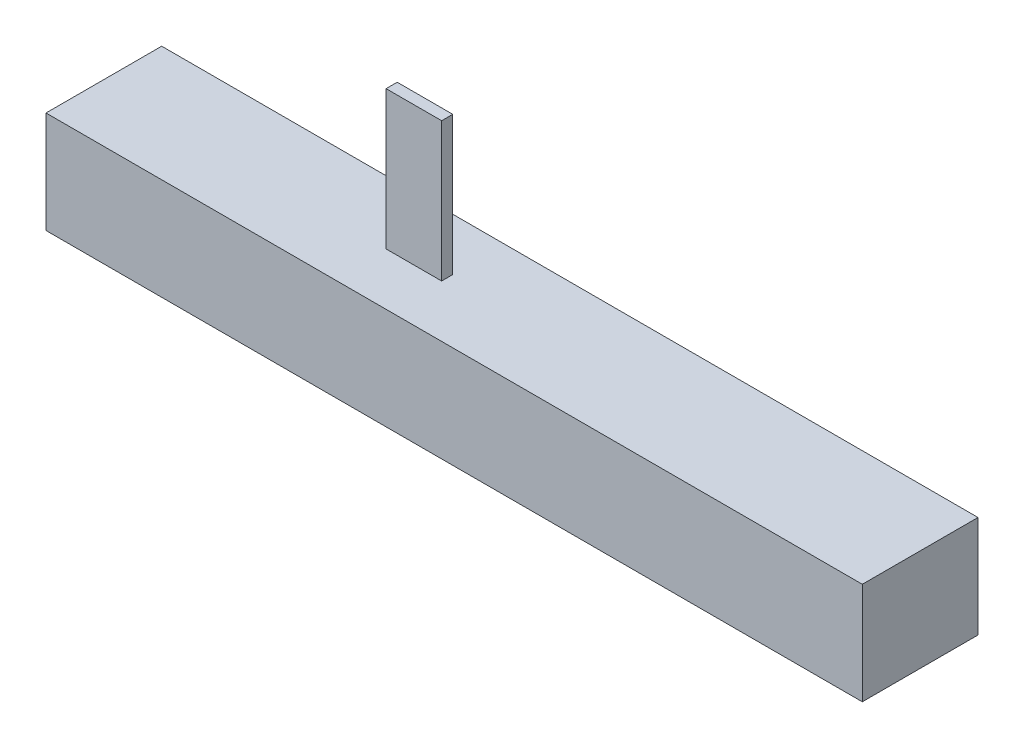
ISO-10303-21;
HEADER;
FILE_DESCRIPTION(('STEP AP214'),'2;1');
FILE_NAME('part.step','',(''),(''),'','','');
FILE_SCHEMA(('AUTOMOTIVE_DESIGN { 1 0 10303 214 1 1 1 1 }'));
ENDSEC;
DATA;
#1=APPLICATION_CONTEXT('core data for automotive mechanical design processes');
#2=APPLICATION_PROTOCOL_DEFINITION('international standard','automotive_design',2000,#1);
#3=PRODUCT_CONTEXT('',#1,'mechanical');
#4=PRODUCT('Part','Part','',(#3));
#5=PRODUCT_RELATED_PRODUCT_CATEGORY('part','',(#4));
#6=PRODUCT_DEFINITION_FORMATION('','',#4);
#7=PRODUCT_DEFINITION_CONTEXT('part definition',#1,'design');
#8=PRODUCT_DEFINITION('design','',#6,#7);
#9=PRODUCT_DEFINITION_SHAPE('','',#8);
#10=(LENGTH_UNIT() NAMED_UNIT(*) SI_UNIT(.MILLI.,.METRE.));
#11=(NAMED_UNIT(*) PLANE_ANGLE_UNIT() SI_UNIT($,.RADIAN.));
#12=(NAMED_UNIT(*) SI_UNIT($,.STERADIAN.) SOLID_ANGLE_UNIT());
#13=UNCERTAINTY_MEASURE_WITH_UNIT(LENGTH_MEASURE(1.E-05),#10,'distance_accuracy_value','');
#14=(GEOMETRIC_REPRESENTATION_CONTEXT(3) GLOBAL_UNCERTAINTY_ASSIGNED_CONTEXT((#13)) GLOBAL_UNIT_ASSIGNED_CONTEXT((#10,
#11,#12)) REPRESENTATION_CONTEXT('',''));
#15=CARTESIAN_POINT('',(0.,0.,0.));
#16=DIRECTION('',(0.,0.,1.));
#17=DIRECTION('',(1.,0.,0.));
#18=AXIS2_PLACEMENT_3D('',#15,#16,#17);
#19=CARTESIAN_POINT('',(-44.1,5.5,12.5));
#20=DIRECTION('',(0.,-1.,0.));
#21=DIRECTION('',(0.,0.,-1.));
#22=AXIS2_PLACEMENT_3D('',#19,#20,#21);
#23=PLANE('',#22);
#24=DIRECTION('',(-1.,0.,0.));
#25=VECTOR('',#24,1.);
#26=CARTESIAN_POINT('',(-44.1,5.5,0.));
#27=LINE('',#26,#25);
#28=CARTESIAN_POINT('',(44.1,5.5,0.));
#29=VERTEX_POINT('',#28);
#30=CARTESIAN_POINT('',(-44.1,5.5,0.));
#31=VERTEX_POINT('',#30);
#32=EDGE_CURVE('E121',#29,#31,#27,.T.);
#33=ORIENTED_EDGE('',*,*,#32,.T.);
#34=DIRECTION('',(0.,0.,-1.));
#35=VECTOR('',#34,1.);
#36=CARTESIAN_POINT('',(-44.1,5.5,12.5));
#37=LINE('',#36,#35);
#38=CARTESIAN_POINT('',(-44.1,5.5,12.5));
#39=VERTEX_POINT('',#38);
#40=EDGE_CURVE('E40',#39,#31,#37,.T.);
#41=ORIENTED_EDGE('',*,*,#40,.F.);
#42=DIRECTION('',(-1.,0.,0.));
#43=VECTOR('',#42,1.);
#44=CARTESIAN_POINT('',(-44.1,5.5,12.5));
#45=LINE('',#44,#43);
#46=CARTESIAN_POINT('',(44.1,5.5,12.5));
#47=VERTEX_POINT('',#46);
#48=EDGE_CURVE('E130',#47,#39,#45,.T.);
#49=ORIENTED_EDGE('',*,*,#48,.F.);
#50=DIRECTION('',(0.,0.,-1.));
#51=VECTOR('',#50,1.);
#52=CARTESIAN_POINT('',(44.1,5.5,12.5));
#53=LINE('',#52,#51);
#54=EDGE_CURVE('E11',#47,#29,#53,.T.);
#55=ORIENTED_EDGE('',*,*,#54,.T.);
#56=EDGE_LOOP('',(#33,#41,#49,#55));
#57=FACE_BOUND('',#56,.T.);
#58=DIRECTION('',(0.,0.,-1.));
#59=VECTOR('',#58,1.);
#60=CARTESIAN_POINT('',(-7.00262736585001,5.5,5.65));
#61=LINE('',#60,#59);
#62=CARTESIAN_POINT('',(-7.00262736585001,5.5,6.85));
#63=VERTEX_POINT('',#62);
#64=CARTESIAN_POINT('',(-7.00262736585001,5.5,5.65));
#65=VERTEX_POINT('',#64);
#66=EDGE_CURVE('E117',#63,#65,#61,.T.);
#67=ORIENTED_EDGE('',*,*,#66,.F.);
#68=DIRECTION('',(1.,0.,0.));
#69=VECTOR('',#68,1.);
#70=CARTESIAN_POINT('',(-13.00262736585,5.5,6.85));
#71=LINE('',#70,#69);
#72=CARTESIAN_POINT('',(-13.00262736585,5.5,6.85));
#73=VERTEX_POINT('',#72);
#74=EDGE_CURVE('E114',#73,#63,#71,.T.);
#75=ORIENTED_EDGE('',*,*,#74,.F.);
#76=DIRECTION('',(0.,0.,1.));
#77=VECTOR('',#76,1.);
#78=CARTESIAN_POINT('',(-13.00262736585,5.5,5.65));
#79=LINE('',#78,#77);
#80=CARTESIAN_POINT('',(-13.00262736585,5.5,5.65));
#81=VERTEX_POINT('',#80);
#82=EDGE_CURVE('E52',#81,#73,#79,.T.);
#83=ORIENTED_EDGE('',*,*,#82,.F.);
#84=DIRECTION('',(-1.,0.,0.));
#85=VECTOR('',#84,1.);
#86=CARTESIAN_POINT('',(-13.00262736585,5.5,5.65));
#87=LINE('',#86,#85);
#88=EDGE_CURVE('E47',#65,#81,#87,.T.);
#89=ORIENTED_EDGE('',*,*,#88,.F.);
#90=EDGE_LOOP('',(#67,#75,#83,#89));
#91=FACE_BOUND('',#90,.T.);
#92=ADVANCED_FACE('F32',(#57,#91),#23,.F.);
#93=CARTESIAN_POINT('',(44.1,-5.5,12.5));
#94=DIRECTION('',(-1.,0.,0.));
#95=DIRECTION('',(0.,0.,1.));
#96=AXIS2_PLACEMENT_3D('',#93,#94,#95);
#97=PLANE('',#96);
#98=DIRECTION('',(0.,1.,0.));
#99=VECTOR('',#98,1.);
#100=CARTESIAN_POINT('',(44.1,-5.5,0.));
#101=LINE('',#100,#99);
#102=CARTESIAN_POINT('',(44.1,-5.5,0.));
#103=VERTEX_POINT('',#102);
#104=EDGE_CURVE('E118',#103,#29,#101,.T.);
#105=ORIENTED_EDGE('',*,*,#104,.T.);
#106=ORIENTED_EDGE('',*,*,#54,.F.);
#107=DIRECTION('',(0.,1.,0.));
#108=VECTOR('',#107,1.);
#109=CARTESIAN_POINT('',(44.1,-5.5,12.5));
#110=LINE('',#109,#108);
#111=CARTESIAN_POINT('',(44.1,-5.5,12.5));
#112=VERTEX_POINT('',#111);
#113=EDGE_CURVE('E127',#112,#47,#110,.T.);
#114=ORIENTED_EDGE('',*,*,#113,.F.);
#115=DIRECTION('',(0.,0.,-1.));
#116=VECTOR('',#115,1.);
#117=CARTESIAN_POINT('',(44.1,-5.5,12.5));
#118=LINE('',#117,#116);
#119=EDGE_CURVE('E136',#112,#103,#118,.T.);
#120=ORIENTED_EDGE('',*,*,#119,.T.);
#121=EDGE_LOOP('',(#105,#106,#114,#120));
#122=FACE_BOUND('',#121,.T.);
#123=ADVANCED_FACE('F34',(#122),#97,.F.);
#124=CARTESIAN_POINT('',(-44.1,-5.5,12.5));
#125=DIRECTION('',(1.,0.,0.));
#126=DIRECTION('',(0.,0.,-1.));
#127=AXIS2_PLACEMENT_3D('',#124,#125,#126);
#128=PLANE('',#127);
#129=DIRECTION('',(0.,-1.,0.));
#130=VECTOR('',#129,1.);
#131=CARTESIAN_POINT('',(-44.1,-5.5,0.));
#132=LINE('',#131,#130);
#133=CARTESIAN_POINT('',(-44.1,-5.5,0.));
#134=VERTEX_POINT('',#133);
#135=EDGE_CURVE('E139',#31,#134,#132,.T.);
#136=ORIENTED_EDGE('',*,*,#135,.T.);
#137=DIRECTION('',(0.,0.,-1.));
#138=VECTOR('',#137,1.);
#139=CARTESIAN_POINT('',(-44.1,-5.5,12.5));
#140=LINE('',#139,#138);
#141=CARTESIAN_POINT('',(-44.1,-5.5,12.5));
#142=VERTEX_POINT('',#141);
#143=EDGE_CURVE('E144',#142,#134,#140,.T.);
#144=ORIENTED_EDGE('',*,*,#143,.F.);
#145=DIRECTION('',(0.,-1.,0.));
#146=VECTOR('',#145,1.);
#147=CARTESIAN_POINT('',(-44.1,-5.5,12.5));
#148=LINE('',#147,#146);
#149=EDGE_CURVE('E133',#39,#142,#148,.T.);
#150=ORIENTED_EDGE('',*,*,#149,.F.);
#151=ORIENTED_EDGE('',*,*,#40,.T.);
#152=EDGE_LOOP('',(#136,#144,#150,#151));
#153=FACE_BOUND('',#152,.T.);
#154=ADVANCED_FACE('F151',(#153),#128,.F.);
#155=CARTESIAN_POINT('',(-44.1,-5.5,12.5));
#156=DIRECTION('',(0.,1.,0.));
#157=DIRECTION('',(0.,0.,1.));
#158=AXIS2_PLACEMENT_3D('',#155,#156,#157);
#159=PLANE('',#158);
#160=DIRECTION('',(1.,0.,0.));
#161=VECTOR('',#160,1.);
#162=CARTESIAN_POINT('',(-44.1,-5.5,0.));
#163=LINE('',#162,#161);
#164=EDGE_CURVE('E131',#134,#103,#163,.T.);
#165=ORIENTED_EDGE('',*,*,#164,.T.);
#166=ORIENTED_EDGE('',*,*,#119,.F.);
#167=DIRECTION('',(1.,0.,0.));
#168=VECTOR('',#167,1.);
#169=CARTESIAN_POINT('',(-44.1,-5.5,12.5));
#170=LINE('',#169,#168);
#171=EDGE_CURVE('E135',#142,#112,#170,.T.);
#172=ORIENTED_EDGE('',*,*,#171,.F.);
#173=ORIENTED_EDGE('',*,*,#143,.T.);
#174=EDGE_LOOP('',(#165,#166,#172,#173));
#175=FACE_BOUND('',#174,.T.);
#176=ADVANCED_FACE('F160',(#175),#159,.F.);
#177=CARTESIAN_POINT('',(0.,0.,12.5));
#178=DIRECTION('',(0.,0.,-1.));
#179=DIRECTION('',(-1.,0.,0.));
#180=AXIS2_PLACEMENT_3D('',#177,#178,#179);
#181=PLANE('',#180);
#182=ORIENTED_EDGE('',*,*,#113,.T.);
#183=ORIENTED_EDGE('',*,*,#48,.T.);
#184=ORIENTED_EDGE('',*,*,#149,.T.);
#185=ORIENTED_EDGE('',*,*,#171,.T.);
#186=EDGE_LOOP('',(#182,#183,#184,#185));
#187=FACE_BOUND('',#186,.T.);
#188=ADVANCED_FACE('F166',(#187),#181,.F.);
#189=CARTESIAN_POINT('',(0.,0.,0.));
#190=DIRECTION('',(0.,0.,-1.));
#191=DIRECTION('',(-1.,0.,0.));
#192=AXIS2_PLACEMENT_3D('',#189,#190,#191);
#193=PLANE('',#192);
#194=ORIENTED_EDGE('',*,*,#104,.F.);
#195=ORIENTED_EDGE('',*,*,#164,.F.);
#196=ORIENTED_EDGE('',*,*,#135,.F.);
#197=ORIENTED_EDGE('',*,*,#32,.F.);
#198=EDGE_LOOP('',(#194,#195,#196,#197));
#199=FACE_BOUND('',#198,.T.);
#200=ADVANCED_FACE('F157',(#199),#193,.T.);
#201=CARTESIAN_POINT('',(-7.00262736585001,20.5,5.65));
#202=DIRECTION('',(-1.,0.,0.));
#203=DIRECTION('',(0.,0.,1.));
#204=AXIS2_PLACEMENT_3D('',#201,#202,#203);
#205=PLANE('',#204);
#206=ORIENTED_EDGE('',*,*,#66,.T.);
#207=DIRECTION('',(0.,-1.,0.));
#208=VECTOR('',#207,1.);
#209=CARTESIAN_POINT('',(-7.00262736585001,20.5,5.65));
#210=LINE('',#209,#208);
#211=CARTESIAN_POINT('',(-7.00262736585001,20.5,5.65));
#212=VERTEX_POINT('',#211);
#213=EDGE_CURVE('E98',#212,#65,#210,.T.);
#214=ORIENTED_EDGE('',*,*,#213,.F.);
#215=DIRECTION('',(0.,0.,-1.));
#216=VECTOR('',#215,1.);
#217=CARTESIAN_POINT('',(-7.00262736585001,20.5,5.65));
#218=LINE('',#217,#216);
#219=CARTESIAN_POINT('',(-7.00262736585001,20.5,6.85));
#220=VERTEX_POINT('',#219);
#221=EDGE_CURVE('E105',#220,#212,#218,.T.);
#222=ORIENTED_EDGE('',*,*,#221,.F.);
#223=DIRECTION('',(0.,-1.,0.));
#224=VECTOR('',#223,1.);
#225=CARTESIAN_POINT('',(-7.00262736585001,20.5,6.85));
#226=LINE('',#225,#224);
#227=EDGE_CURVE('E173',#220,#63,#226,.T.);
#228=ORIENTED_EDGE('',*,*,#227,.T.);
#229=EDGE_LOOP('',(#206,#214,#222,#228));
#230=FACE_BOUND('',#229,.T.);
#231=ADVANCED_FACE('F116',(#230),#205,.F.);
#232=CARTESIAN_POINT('',(-13.00262736585,20.5,5.65));
#233=DIRECTION('',(0.,0.,1.));
#234=DIRECTION('',(1.,0.,0.));
#235=AXIS2_PLACEMENT_3D('',#232,#233,#234);
#236=PLANE('',#235);
#237=ORIENTED_EDGE('',*,*,#88,.T.);
#238=DIRECTION('',(0.,-1.,0.));
#239=VECTOR('',#238,1.);
#240=CARTESIAN_POINT('',(-13.00262736585,20.5,5.65));
#241=LINE('',#240,#239);
#242=CARTESIAN_POINT('',(-13.00262736585,20.5,5.65));
#243=VERTEX_POINT('',#242);
#244=EDGE_CURVE('E101',#243,#81,#241,.T.);
#245=ORIENTED_EDGE('',*,*,#244,.F.);
#246=DIRECTION('',(-1.,0.,0.));
#247=VECTOR('',#246,1.);
#248=CARTESIAN_POINT('',(-13.00262736585,20.5,5.65));
#249=LINE('',#248,#247);
#250=EDGE_CURVE('E94',#212,#243,#249,.T.);
#251=ORIENTED_EDGE('',*,*,#250,.F.);
#252=ORIENTED_EDGE('',*,*,#213,.T.);
#253=EDGE_LOOP('',(#237,#245,#251,#252));
#254=FACE_BOUND('',#253,.T.);
#255=ADVANCED_FACE('F96',(#254),#236,.F.);
#256=CARTESIAN_POINT('',(-13.00262736585,20.5,5.65));
#257=DIRECTION('',(1.,0.,0.));
#258=DIRECTION('',(0.,0.,-1.));
#259=AXIS2_PLACEMENT_3D('',#256,#257,#258);
#260=PLANE('',#259);
#261=ORIENTED_EDGE('',*,*,#82,.T.);
#262=DIRECTION('',(0.,-1.,0.));
#263=VECTOR('',#262,1.);
#264=CARTESIAN_POINT('',(-13.00262736585,20.5,6.85));
#265=LINE('',#264,#263);
#266=CARTESIAN_POINT('',(-13.00262736585,20.5,6.85));
#267=VERTEX_POINT('',#266);
#268=EDGE_CURVE('E123',#267,#73,#265,.T.);
#269=ORIENTED_EDGE('',*,*,#268,.F.);
#270=DIRECTION('',(0.,0.,1.));
#271=VECTOR('',#270,1.);
#272=CARTESIAN_POINT('',(-13.00262736585,20.5,5.65));
#273=LINE('',#272,#271);
#274=EDGE_CURVE('E104',#243,#267,#273,.T.);
#275=ORIENTED_EDGE('',*,*,#274,.F.);
#276=ORIENTED_EDGE('',*,*,#244,.T.);
#277=EDGE_LOOP('',(#261,#269,#275,#276));
#278=FACE_BOUND('',#277,.T.);
#279=ADVANCED_FACE('F182',(#278),#260,.F.);
#280=CARTESIAN_POINT('',(-13.00262736585,20.5,6.85));
#281=DIRECTION('',(0.,0.,-1.));
#282=DIRECTION('',(-1.,0.,0.));
#283=AXIS2_PLACEMENT_3D('',#280,#281,#282);
#284=PLANE('',#283);
#285=ORIENTED_EDGE('',*,*,#74,.T.);
#286=ORIENTED_EDGE('',*,*,#227,.F.);
#287=DIRECTION('',(1.,0.,0.));
#288=VECTOR('',#287,1.);
#289=CARTESIAN_POINT('',(-13.00262736585,20.5,6.85));
#290=LINE('',#289,#288);
#291=EDGE_CURVE('E110',#267,#220,#290,.T.);
#292=ORIENTED_EDGE('',*,*,#291,.F.);
#293=ORIENTED_EDGE('',*,*,#268,.T.);
#294=EDGE_LOOP('',(#285,#286,#292,#293));
#295=FACE_BOUND('',#294,.T.);
#296=ADVANCED_FACE('F172',(#295),#284,.F.);
#297=CARTESIAN_POINT('',(0.,20.5,0.));
#298=DIRECTION('',(0.,1.,0.));
#299=DIRECTION('',(0.,0.,1.));
#300=AXIS2_PLACEMENT_3D('',#297,#298,#299);
#301=PLANE('',#300);
#302=ORIENTED_EDGE('',*,*,#221,.T.);
#303=ORIENTED_EDGE('',*,*,#250,.T.);
#304=ORIENTED_EDGE('',*,*,#274,.T.);
#305=ORIENTED_EDGE('',*,*,#291,.T.);
#306=EDGE_LOOP('',(#302,#303,#304,#305));
#307=FACE_BOUND('',#306,.T.);
#308=ADVANCED_FACE('F108',(#307),#301,.T.);
#309=CLOSED_SHELL('',(#92,#123,#154,#176,#188,#200,#231,#255,#279,#296,#308));
#310=MANIFOLD_SOLID_BREP('B2',#309);
#311=ADVANCED_BREP_SHAPE_REPRESENTATION('',(#18,#310),#14);
#312=SHAPE_DEFINITION_REPRESENTATION(#9,#311);
ENDSEC;
END-ISO-10303-21;
